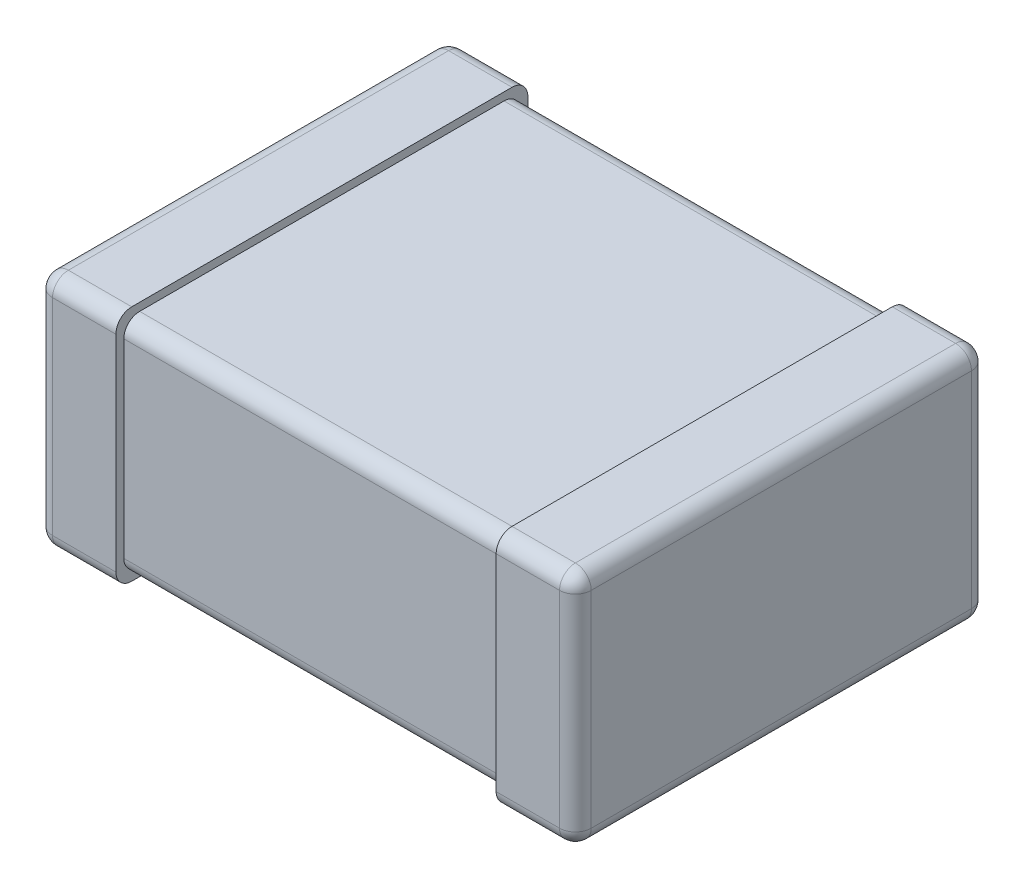
ISO-10303-21;
HEADER;
FILE_DESCRIPTION(('STEP AP214'),'2;1');
FILE_NAME('part.step','',(''),(''),'','','');
FILE_SCHEMA(('AUTOMOTIVE_DESIGN { 1 0 10303 214 1 1 1 1 }'));
ENDSEC;
DATA;
#1=APPLICATION_CONTEXT('core data for automotive mechanical design processes');
#2=APPLICATION_PROTOCOL_DEFINITION('international standard','automotive_design',2000,#1);
#3=PRODUCT_CONTEXT('',#1,'mechanical');
#4=PRODUCT('Part','Part','',(#3));
#5=PRODUCT_RELATED_PRODUCT_CATEGORY('part','',(#4));
#6=PRODUCT_DEFINITION_FORMATION('','',#4);
#7=PRODUCT_DEFINITION_CONTEXT('part definition',#1,'design');
#8=PRODUCT_DEFINITION('design','',#6,#7);
#9=PRODUCT_DEFINITION_SHAPE('','',#8);
#10=(LENGTH_UNIT() NAMED_UNIT(*) SI_UNIT(.MILLI.,.METRE.));
#11=(NAMED_UNIT(*) PLANE_ANGLE_UNIT() SI_UNIT($,.RADIAN.));
#12=(NAMED_UNIT(*) SI_UNIT($,.STERADIAN.) SOLID_ANGLE_UNIT());
#13=UNCERTAINTY_MEASURE_WITH_UNIT(LENGTH_MEASURE(1.E-05),#10,'distance_accuracy_value','');
#14=(GEOMETRIC_REPRESENTATION_CONTEXT(3) GLOBAL_UNCERTAINTY_ASSIGNED_CONTEXT((#13)) GLOBAL_UNIT_ASSIGNED_CONTEXT((#10,
#11,#12)) REPRESENTATION_CONTEXT('',''));
#15=CARTESIAN_POINT('',(0.,0.,0.));
#16=DIRECTION('',(0.,0.,1.));
#17=DIRECTION('',(1.,0.,0.));
#18=AXIS2_PLACEMENT_3D('',#15,#16,#17);
#19=CARTESIAN_POINT('',(0.5,1.5,-1.3));
#20=DIRECTION('',(0.,0.,1.));
#21=DIRECTION('',(1.,0.,0.));
#22=AXIS2_PLACEMENT_3D('',#19,#20,#21);
#23=PLANE('',#22);
#24=DIRECTION('',(0.,-1.,0.));
#25=VECTOR('',#24,1.);
#26=CARTESIAN_POINT('',(0.0999999999999995,1.5,-1.3));
#27=LINE('',#26,#25);
#28=CARTESIAN_POINT('',(0.0999999999999995,0.1,-1.3));
#29=VERTEX_POINT('',#28);
#30=CARTESIAN_POINT('',(0.0999999999999995,1.4,-1.3));
#31=VERTEX_POINT('',#30);
#32=EDGE_CURVE('E320',#29,#31,#27,.F.);
#33=ORIENTED_EDGE('',*,*,#32,.T.);
#34=DIRECTION('',(-1.,0.,0.));
#35=VECTOR('',#34,1.);
#36=CARTESIAN_POINT('',(0.5,1.4,-1.3));
#37=LINE('',#36,#35);
#38=CARTESIAN_POINT('',(0.5,1.4,-1.3));
#39=VERTEX_POINT('',#38);
#40=EDGE_CURVE('E324',#31,#39,#37,.F.);
#41=ORIENTED_EDGE('',*,*,#40,.T.);
#42=DIRECTION('',(0.,-1.,0.));
#43=VECTOR('',#42,1.);
#44=CARTESIAN_POINT('',(0.5,1.5,-1.3));
#45=LINE('',#44,#43);
#46=CARTESIAN_POINT('',(0.5,0.1,-1.3));
#47=VERTEX_POINT('',#46);
#48=EDGE_CURVE('E254',#39,#47,#45,.T.);
#49=ORIENTED_EDGE('',*,*,#48,.T.);
#50=DIRECTION('',(-1.,0.,0.));
#51=VECTOR('',#50,1.);
#52=CARTESIAN_POINT('',(0.5,0.1,-1.3));
#53=LINE('',#52,#51);
#54=EDGE_CURVE('E322',#47,#29,#53,.T.);
#55=ORIENTED_EDGE('',*,*,#54,.T.);
#56=EDGE_LOOP('',(#33,#41,#49,#55));
#57=FACE_BOUND('',#56,.T.);
#58=ADVANCED_FACE('F36',(#57),#23,.F.);
#59=CARTESIAN_POINT('',(0.,1.5,-1.3));
#60=DIRECTION('',(1.,0.,0.));
#61=DIRECTION('',(0.,0.,-1.));
#62=AXIS2_PLACEMENT_3D('',#59,#60,#61);
#63=PLANE('',#62);
#64=DIRECTION('',(0.,0.,1.));
#65=VECTOR('',#64,1.);
#66=CARTESIAN_POINT('',(0.,1.4,-1.3));
#67=LINE('',#66,#65);
#68=CARTESIAN_POINT('',(0.,1.4,1.2));
#69=VERTEX_POINT('',#68);
#70=CARTESIAN_POINT('',(0.,1.4,-1.2));
#71=VERTEX_POINT('',#70);
#72=EDGE_CURVE('E340',#69,#71,#67,.F.);
#73=ORIENTED_EDGE('',*,*,#72,.T.);
#74=DIRECTION('',(0.,-1.,0.));
#75=VECTOR('',#74,1.);
#76=CARTESIAN_POINT('',(0.,1.5,-1.2));
#77=LINE('',#76,#75);
#78=CARTESIAN_POINT('',(0.,0.1,-1.2));
#79=VERTEX_POINT('',#78);
#80=EDGE_CURVE('E346',#71,#79,#77,.T.);
#81=ORIENTED_EDGE('',*,*,#80,.T.);
#82=DIRECTION('',(0.,0.,1.));
#83=VECTOR('',#82,1.);
#84=CARTESIAN_POINT('',(0.,0.1,-1.3));
#85=LINE('',#84,#83);
#86=CARTESIAN_POINT('',(0.,0.1,1.2));
#87=VERTEX_POINT('',#86);
#88=EDGE_CURVE('E344',#79,#87,#85,.T.);
#89=ORIENTED_EDGE('',*,*,#88,.T.);
#90=DIRECTION('',(0.,-1.,0.));
#91=VECTOR('',#90,1.);
#92=CARTESIAN_POINT('',(0.,1.5,1.2));
#93=LINE('',#92,#91);
#94=EDGE_CURVE('E342',#87,#69,#93,.F.);
#95=ORIENTED_EDGE('',*,*,#94,.T.);
#96=EDGE_LOOP('',(#73,#81,#89,#95));
#97=FACE_BOUND('',#96,.T.);
#98=ADVANCED_FACE('F457',(#97),#63,.F.);
#99=CARTESIAN_POINT('',(0.,1.5,1.3));
#100=DIRECTION('',(0.,0.,-1.));
#101=DIRECTION('',(-1.,0.,0.));
#102=AXIS2_PLACEMENT_3D('',#99,#100,#101);
#103=PLANE('',#102);
#104=DIRECTION('',(0.,-1.,0.));
#105=VECTOR('',#104,1.);
#106=CARTESIAN_POINT('',(0.1,1.5,1.3));
#107=LINE('',#106,#105);
#108=CARTESIAN_POINT('',(0.1,1.4,1.3));
#109=VERTEX_POINT('',#108);
#110=CARTESIAN_POINT('',(0.1,0.1,1.3));
#111=VERTEX_POINT('',#110);
#112=EDGE_CURVE('E53',#109,#111,#107,.T.);
#113=ORIENTED_EDGE('',*,*,#112,.T.);
#114=DIRECTION('',(1.,0.,0.));
#115=VECTOR('',#114,1.);
#116=CARTESIAN_POINT('',(0.,0.1,1.3));
#117=LINE('',#116,#115);
#118=CARTESIAN_POINT('',(0.5,0.1,1.3));
#119=VERTEX_POINT('',#118);
#120=EDGE_CURVE('E351',#111,#119,#117,.T.);
#121=ORIENTED_EDGE('',*,*,#120,.T.);
#122=DIRECTION('',(0.,-1.,0.));
#123=VECTOR('',#122,1.);
#124=CARTESIAN_POINT('',(0.5,1.5,1.3));
#125=LINE('',#124,#123);
#126=CARTESIAN_POINT('',(0.5,1.4,1.3));
#127=VERTEX_POINT('',#126);
#128=EDGE_CURVE('E249',#127,#119,#125,.T.);
#129=ORIENTED_EDGE('',*,*,#128,.F.);
#130=DIRECTION('',(1.,0.,0.));
#131=VECTOR('',#130,1.);
#132=CARTESIAN_POINT('',(0.,1.4,1.3));
#133=LINE('',#132,#131);
#134=EDGE_CURVE('E58',#127,#109,#133,.F.);
#135=ORIENTED_EDGE('',*,*,#134,.T.);
#136=EDGE_LOOP('',(#113,#121,#129,#135));
#137=FACE_BOUND('',#136,.T.);
#138=ADVANCED_FACE('F438',(#137),#103,.F.);
#139=CARTESIAN_POINT('',(0.5,1.5,1.3));
#140=DIRECTION('',(-1.,0.,0.));
#141=DIRECTION('',(0.,0.,1.));
#142=AXIS2_PLACEMENT_3D('',#139,#140,#141);
#143=PLANE('',#142);
#144=DIRECTION('',(0.,-1.,0.));
#145=VECTOR('',#144,1.);
#146=CARTESIAN_POINT('',(0.5,1.45,1.25));
#147=LINE('',#146,#145);
#148=CARTESIAN_POINT('',(0.5,1.35,1.25));
#149=VERTEX_POINT('',#148);
#150=CARTESIAN_POINT('',(0.5,0.15,1.25));
#151=VERTEX_POINT('',#150);
#152=EDGE_CURVE('E245',#149,#151,#147,.T.);
#153=ORIENTED_EDGE('',*,*,#152,.F.);
#154=CARTESIAN_POINT('',(0.5,1.35,1.15));
#155=DIRECTION('',(-1.,0.,0.));
#156=DIRECTION('',(0.,0.,1.));
#157=AXIS2_PLACEMENT_3D('',#154,#155,#156);
#158=CIRCLE('',#157,0.1);
#159=CARTESIAN_POINT('',(0.5,1.45,1.15));
#160=VERTEX_POINT('',#159);
#161=EDGE_CURVE('E12',#149,#160,#158,.T.);
#162=ORIENTED_EDGE('',*,*,#161,.T.);
#163=DIRECTION('',(0.,0.,1.));
#164=VECTOR('',#163,1.);
#165=CARTESIAN_POINT('',(0.5,1.45,-1.25));
#166=LINE('',#165,#164);
#167=CARTESIAN_POINT('',(0.5,1.45,-1.15));
#168=VERTEX_POINT('',#167);
#169=EDGE_CURVE('E228',#168,#160,#166,.T.);
#170=ORIENTED_EDGE('',*,*,#169,.F.);
#171=CARTESIAN_POINT('',(0.5,1.35,-1.15));
#172=DIRECTION('',(-1.,0.,0.));
#173=DIRECTION('',(0.,0.,1.));
#174=AXIS2_PLACEMENT_3D('',#171,#172,#173);
#175=CIRCLE('',#174,0.1);
#176=CARTESIAN_POINT('',(0.5,1.35,-1.25));
#177=VERTEX_POINT('',#176);
#178=EDGE_CURVE('E221',#168,#177,#175,.T.);
#179=ORIENTED_EDGE('',*,*,#178,.T.);
#180=DIRECTION('',(0.,-1.,0.));
#181=VECTOR('',#180,1.);
#182=CARTESIAN_POINT('',(0.5,1.45,-1.25));
#183=LINE('',#182,#181);
#184=CARTESIAN_POINT('',(0.5,0.15,-1.25));
#185=VERTEX_POINT('',#184);
#186=EDGE_CURVE('E226',#177,#185,#183,.T.);
#187=ORIENTED_EDGE('',*,*,#186,.T.);
#188=CARTESIAN_POINT('',(0.5,0.15,-1.15));
#189=DIRECTION('',(-1.,0.,0.));
#190=DIRECTION('',(0.,0.,1.));
#191=AXIS2_PLACEMENT_3D('',#188,#189,#190);
#192=CIRCLE('',#191,0.1);
#193=CARTESIAN_POINT('',(0.5,0.05,-1.15));
#194=VERTEX_POINT('',#193);
#195=EDGE_CURVE('E353',#185,#194,#192,.T.);
#196=ORIENTED_EDGE('',*,*,#195,.T.);
#197=DIRECTION('',(0.,0.,1.));
#198=VECTOR('',#197,1.);
#199=CARTESIAN_POINT('',(0.5,0.05,-1.25));
#200=LINE('',#199,#198);
#201=CARTESIAN_POINT('',(0.5,0.05,1.15));
#202=VERTEX_POINT('',#201);
#203=EDGE_CURVE('E490',#194,#202,#200,.T.);
#204=ORIENTED_EDGE('',*,*,#203,.T.);
#205=CARTESIAN_POINT('',(0.5,0.15,1.15));
#206=DIRECTION('',(-1.,0.,0.));
#207=DIRECTION('',(0.,0.,1.));
#208=AXIS2_PLACEMENT_3D('',#205,#206,#207);
#209=CIRCLE('',#208,0.1);
#210=EDGE_CURVE('E359',#202,#151,#209,.T.);
#211=ORIENTED_EDGE('',*,*,#210,.T.);
#212=EDGE_LOOP('',(#153,#162,#170,#179,#187,#196,#204,#211));
#213=FACE_BOUND('',#212,.T.);
#214=ORIENTED_EDGE('',*,*,#48,.F.);
#215=CARTESIAN_POINT('',(0.5,1.4,-1.2));
#216=DIRECTION('',(-1.,0.,0.));
#217=DIRECTION('',(0.,0.,1.));
#218=AXIS2_PLACEMENT_3D('',#215,#216,#217);
#219=CIRCLE('',#218,0.1);
#220=CARTESIAN_POINT('',(0.5,1.5,-1.2));
#221=VERTEX_POINT('',#220);
#222=EDGE_CURVE('E332',#39,#221,#219,.F.);
#223=ORIENTED_EDGE('',*,*,#222,.T.);
#224=DIRECTION('',(0.,0.,-1.));
#225=VECTOR('',#224,1.);
#226=CARTESIAN_POINT('',(0.5,1.5,1.3));
#227=LINE('',#226,#225);
#228=CARTESIAN_POINT('',(0.5,1.5,1.2));
#229=VERTEX_POINT('',#228);
#230=EDGE_CURVE('E445',#229,#221,#227,.T.);
#231=ORIENTED_EDGE('',*,*,#230,.F.);
#232=CARTESIAN_POINT('',(0.5,1.4,1.2));
#233=DIRECTION('',(-1.,0.,0.));
#234=DIRECTION('',(0.,0.,1.));
#235=AXIS2_PLACEMENT_3D('',#232,#233,#234);
#236=CIRCLE('',#235,0.1);
#237=EDGE_CURVE('E326',#229,#127,#236,.F.);
#238=ORIENTED_EDGE('',*,*,#237,.T.);
#239=ORIENTED_EDGE('',*,*,#128,.T.);
#240=CARTESIAN_POINT('',(0.5,0.1,1.2));
#241=DIRECTION('',(-1.,0.,0.));
#242=DIRECTION('',(0.,0.,1.));
#243=AXIS2_PLACEMENT_3D('',#240,#241,#242);
#244=CIRCLE('',#243,0.1);
#245=CARTESIAN_POINT('',(0.5,0.,1.2));
#246=VERTEX_POINT('',#245);
#247=EDGE_CURVE('E328',#119,#246,#244,.F.);
#248=ORIENTED_EDGE('',*,*,#247,.T.);
#249=DIRECTION('',(0.,0.,-1.));
#250=VECTOR('',#249,1.);
#251=CARTESIAN_POINT('',(0.5,0.,1.3));
#252=LINE('',#251,#250);
#253=CARTESIAN_POINT('',(0.5,0.,-1.2));
#254=VERTEX_POINT('',#253);
#255=EDGE_CURVE('E244',#246,#254,#252,.T.);
#256=ORIENTED_EDGE('',*,*,#255,.T.);
#257=CARTESIAN_POINT('',(0.5,0.1,-1.2));
#258=DIRECTION('',(-1.,0.,0.));
#259=DIRECTION('',(0.,0.,1.));
#260=AXIS2_PLACEMENT_3D('',#257,#258,#259);
#261=CIRCLE('',#260,0.1);
#262=EDGE_CURVE('E330',#254,#47,#261,.F.);
#263=ORIENTED_EDGE('',*,*,#262,.T.);
#264=EDGE_LOOP('',(#214,#223,#231,#238,#239,#248,#256,#263));
#265=FACE_BOUND('',#264,.T.);
#266=ADVANCED_FACE('F224',(#213,#265),#143,.F.);
#267=CARTESIAN_POINT('',(0.,1.5,-1.3));
#268=DIRECTION('',(0.,1.,0.));
#269=DIRECTION('',(0.,0.,1.));
#270=AXIS2_PLACEMENT_3D('',#267,#268,#269);
#271=PLANE('',#270);
#272=ORIENTED_EDGE('',*,*,#230,.T.);
#273=DIRECTION('',(-1.,0.,0.));
#274=VECTOR('',#273,1.);
#275=CARTESIAN_POINT('',(0.,1.5,-1.2));
#276=LINE('',#275,#274);
#277=CARTESIAN_POINT('',(0.0999999999999996,1.5,-1.2));
#278=VERTEX_POINT('',#277);
#279=EDGE_CURVE('E317',#221,#278,#276,.T.);
#280=ORIENTED_EDGE('',*,*,#279,.T.);
#281=DIRECTION('',(0.,0.,1.));
#282=VECTOR('',#281,1.);
#283=CARTESIAN_POINT('',(0.1,1.5,1.3));
#284=LINE('',#283,#282);
#285=CARTESIAN_POINT('',(0.1,1.5,1.2));
#286=VERTEX_POINT('',#285);
#287=EDGE_CURVE('E313',#278,#286,#284,.T.);
#288=ORIENTED_EDGE('',*,*,#287,.T.);
#289=DIRECTION('',(1.,0.,0.));
#290=VECTOR('',#289,1.);
#291=CARTESIAN_POINT('',(0.5,1.5,1.2));
#292=LINE('',#291,#290);
#293=EDGE_CURVE('E315',#286,#229,#292,.T.);
#294=ORIENTED_EDGE('',*,*,#293,.T.);
#295=EDGE_LOOP('',(#272,#280,#288,#294));
#296=FACE_BOUND('',#295,.T.);
#297=ADVANCED_FACE('F899',(#296),#271,.T.);
#298=CARTESIAN_POINT('',(0.,0.,-1.3));
#299=DIRECTION('',(0.,1.,0.));
#300=DIRECTION('',(0.,0.,1.));
#301=AXIS2_PLACEMENT_3D('',#298,#299,#300);
#302=PLANE('',#301);
#303=DIRECTION('',(0.,0.,1.));
#304=VECTOR('',#303,1.);
#305=CARTESIAN_POINT('',(0.0999999999999995,0.,-1.3));
#306=LINE('',#305,#304);
#307=CARTESIAN_POINT('',(0.1,0.,1.2));
#308=VERTEX_POINT('',#307);
#309=CARTESIAN_POINT('',(0.0999999999999995,0.,-1.2));
#310=VERTEX_POINT('',#309);
#311=EDGE_CURVE('E336',#308,#310,#306,.F.);
#312=ORIENTED_EDGE('',*,*,#311,.T.);
#313=DIRECTION('',(-1.,0.,0.));
#314=VECTOR('',#313,1.);
#315=CARTESIAN_POINT('',(0.,0.,-1.2));
#316=LINE('',#315,#314);
#317=EDGE_CURVE('E338',#310,#254,#316,.F.);
#318=ORIENTED_EDGE('',*,*,#317,.T.);
#319=ORIENTED_EDGE('',*,*,#255,.F.);
#320=DIRECTION('',(1.,0.,0.));
#321=VECTOR('',#320,1.);
#322=CARTESIAN_POINT('',(0.,0.,1.2));
#323=LINE('',#322,#321);
#324=EDGE_CURVE('E334',#246,#308,#323,.F.);
#325=ORIENTED_EDGE('',*,*,#324,.T.);
#326=EDGE_LOOP('',(#312,#318,#319,#325));
#327=FACE_BOUND('',#326,.T.);
#328=ADVANCED_FACE('F465',(#327),#302,.F.);
#329=CARTESIAN_POINT('',(2.9,1.45,-1.25));
#330=DIRECTION('',(0.,0.,1.));
#331=DIRECTION('',(1.,0.,0.));
#332=AXIS2_PLACEMENT_3D('',#329,#330,#331);
#333=PLANE('',#332);
#334=DIRECTION('',(0.,-1.,0.));
#335=VECTOR('',#334,1.);
#336=CARTESIAN_POINT('',(2.9,1.45,-1.25));
#337=LINE('',#336,#335);
#338=CARTESIAN_POINT('',(2.9,1.35,-1.25));
#339=VERTEX_POINT('',#338);
#340=CARTESIAN_POINT('',(2.9,0.15,-1.25));
#341=VERTEX_POINT('',#340);
#342=EDGE_CURVE('E484',#339,#341,#337,.T.);
#343=ORIENTED_EDGE('',*,*,#342,.T.);
#344=DIRECTION('',(-1.,0.,0.));
#345=VECTOR('',#344,1.);
#346=CARTESIAN_POINT('',(2.9,0.15,-1.25));
#347=LINE('',#346,#345);
#348=EDGE_CURVE('E243',#341,#185,#347,.T.);
#349=ORIENTED_EDGE('',*,*,#348,.T.);
#350=ORIENTED_EDGE('',*,*,#186,.F.);
#351=DIRECTION('',(-1.,0.,0.));
#352=VECTOR('',#351,1.);
#353=CARTESIAN_POINT('',(2.9,1.35,-1.25));
#354=LINE('',#353,#352);
#355=EDGE_CURVE('E240',#177,#339,#354,.F.);
#356=ORIENTED_EDGE('',*,*,#355,.T.);
#357=EDGE_LOOP('',(#343,#349,#350,#356));
#358=FACE_BOUND('',#357,.T.);
#359=ADVANCED_FACE('F239',(#358),#333,.F.);
#360=CARTESIAN_POINT('',(0.5,1.45,1.25));
#361=DIRECTION('',(0.,0.,-1.));
#362=DIRECTION('',(-1.,0.,0.));
#363=AXIS2_PLACEMENT_3D('',#360,#361,#362);
#364=PLANE('',#363);
#365=ORIENTED_EDGE('',*,*,#152,.T.);
#366=DIRECTION('',(1.,0.,0.));
#367=VECTOR('',#366,1.);
#368=CARTESIAN_POINT('',(0.5,0.15,1.25));
#369=LINE('',#368,#367);
#370=CARTESIAN_POINT('',(2.9,0.15,1.25));
#371=VERTEX_POINT('',#370);
#372=EDGE_CURVE('E268',#151,#371,#369,.T.);
#373=ORIENTED_EDGE('',*,*,#372,.T.);
#374=DIRECTION('',(0.,-1.,0.));
#375=VECTOR('',#374,1.);
#376=CARTESIAN_POINT('',(2.9,1.45,1.25));
#377=LINE('',#376,#375);
#378=CARTESIAN_POINT('',(2.9,1.35,1.25));
#379=VERTEX_POINT('',#378);
#380=EDGE_CURVE('E481',#379,#371,#377,.T.);
#381=ORIENTED_EDGE('',*,*,#380,.F.);
#382=DIRECTION('',(1.,0.,0.));
#383=VECTOR('',#382,1.);
#384=CARTESIAN_POINT('',(0.5,1.35,1.25));
#385=LINE('',#384,#383);
#386=EDGE_CURVE('E266',#379,#149,#385,.F.);
#387=ORIENTED_EDGE('',*,*,#386,.T.);
#388=EDGE_LOOP('',(#365,#373,#381,#387));
#389=FACE_BOUND('',#388,.T.);
#390=ADVANCED_FACE('F834',(#389),#364,.F.);
#391=CARTESIAN_POINT('',(0.5,1.45,-1.25));
#392=DIRECTION('',(0.,1.,0.));
#393=DIRECTION('',(0.,0.,1.));
#394=AXIS2_PLACEMENT_3D('',#391,#392,#393);
#395=PLANE('',#394);
#396=DIRECTION('',(0.,0.,-1.));
#397=VECTOR('',#396,1.);
#398=CARTESIAN_POINT('',(2.9,1.45,1.25));
#399=LINE('',#398,#397);
#400=CARTESIAN_POINT('',(2.9,1.45,1.15));
#401=VERTEX_POINT('',#400);
#402=CARTESIAN_POINT('',(2.9,1.45,-1.15));
#403=VERTEX_POINT('',#402);
#404=EDGE_CURVE('E486',#401,#403,#399,.T.);
#405=ORIENTED_EDGE('',*,*,#404,.T.);
#406=DIRECTION('',(-1.,0.,0.));
#407=VECTOR('',#406,1.);
#408=CARTESIAN_POINT('',(0.5,1.45,-1.15));
#409=LINE('',#408,#407);
#410=EDGE_CURVE('E264',#403,#168,#409,.T.);
#411=ORIENTED_EDGE('',*,*,#410,.T.);
#412=ORIENTED_EDGE('',*,*,#169,.T.);
#413=DIRECTION('',(1.,0.,0.));
#414=VECTOR('',#413,1.);
#415=CARTESIAN_POINT('',(2.9,1.45,1.15));
#416=LINE('',#415,#414);
#417=EDGE_CURVE('E261',#160,#401,#416,.T.);
#418=ORIENTED_EDGE('',*,*,#417,.T.);
#419=EDGE_LOOP('',(#405,#411,#412,#418));
#420=FACE_BOUND('',#419,.T.);
#421=ADVANCED_FACE('F824',(#420),#395,.T.);
#422=CARTESIAN_POINT('',(0.5,0.05,-1.25));
#423=DIRECTION('',(0.,1.,0.));
#424=DIRECTION('',(0.,0.,1.));
#425=AXIS2_PLACEMENT_3D('',#422,#423,#424);
#426=PLANE('',#425);
#427=ORIENTED_EDGE('',*,*,#203,.F.);
#428=DIRECTION('',(-1.,0.,0.));
#429=VECTOR('',#428,1.);
#430=CARTESIAN_POINT('',(0.5,0.05,-1.15));
#431=LINE('',#430,#429);
#432=CARTESIAN_POINT('',(2.9,0.05,-1.15));
#433=VERTEX_POINT('',#432);
#434=EDGE_CURVE('E259',#194,#433,#431,.F.);
#435=ORIENTED_EDGE('',*,*,#434,.T.);
#436=DIRECTION('',(0.,0.,-1.));
#437=VECTOR('',#436,1.);
#438=CARTESIAN_POINT('',(2.9,0.05,1.25));
#439=LINE('',#438,#437);
#440=CARTESIAN_POINT('',(2.9,0.05,1.15));
#441=VERTEX_POINT('',#440);
#442=EDGE_CURVE('E487',#441,#433,#439,.T.);
#443=ORIENTED_EDGE('',*,*,#442,.F.);
#444=DIRECTION('',(1.,0.,0.));
#445=VECTOR('',#444,1.);
#446=CARTESIAN_POINT('',(0.499999999999999,0.05,1.15));
#447=LINE('',#446,#445);
#448=EDGE_CURVE('E251',#441,#202,#447,.F.);
#449=ORIENTED_EDGE('',*,*,#448,.T.);
#450=EDGE_LOOP('',(#427,#435,#443,#449));
#451=FACE_BOUND('',#450,.T.);
#452=ADVANCED_FACE('F818',(#451),#426,.F.);
#453=CARTESIAN_POINT('',(2.9,1.5,-1.3));
#454=DIRECTION('',(0.,0.,1.));
#455=DIRECTION('',(1.,0.,0.));
#456=AXIS2_PLACEMENT_3D('',#453,#454,#455);
#457=PLANE('',#456);
#458=DIRECTION('',(0.,-1.,0.));
#459=VECTOR('',#458,1.);
#460=CARTESIAN_POINT('',(2.9,1.5,-1.3));
#461=LINE('',#460,#459);
#462=CARTESIAN_POINT('',(2.9,1.4,-1.3));
#463=VERTEX_POINT('',#462);
#464=CARTESIAN_POINT('',(2.9,0.1,-1.3));
#465=VERTEX_POINT('',#464);
#466=EDGE_CURVE('E493',#463,#465,#461,.T.);
#467=ORIENTED_EDGE('',*,*,#466,.F.);
#468=DIRECTION('',(-1.,0.,0.));
#469=VECTOR('',#468,1.);
#470=CARTESIAN_POINT('',(2.9,1.4,-1.3));
#471=LINE('',#470,#469);
#472=CARTESIAN_POINT('',(3.3,1.4,-1.3));
#473=VERTEX_POINT('',#472);
#474=EDGE_CURVE('E296',#463,#473,#471,.F.);
#475=ORIENTED_EDGE('',*,*,#474,.T.);
#476=DIRECTION('',(0.,-1.,0.));
#477=VECTOR('',#476,1.);
#478=CARTESIAN_POINT('',(3.3,1.5,-1.3));
#479=LINE('',#478,#477);
#480=CARTESIAN_POINT('',(3.3,0.1,-1.3));
#481=VERTEX_POINT('',#480);
#482=EDGE_CURVE('E292',#473,#481,#479,.T.);
#483=ORIENTED_EDGE('',*,*,#482,.T.);
#484=DIRECTION('',(-1.,0.,0.));
#485=VECTOR('',#484,1.);
#486=CARTESIAN_POINT('',(2.9,0.1,-1.3));
#487=LINE('',#486,#485);
#488=EDGE_CURVE('E294',#481,#465,#487,.T.);
#489=ORIENTED_EDGE('',*,*,#488,.T.);
#490=EDGE_LOOP('',(#467,#475,#483,#489));
#491=FACE_BOUND('',#490,.T.);
#492=ADVANCED_FACE('F543',(#491),#457,.F.);
#493=CARTESIAN_POINT('',(2.9,1.5,-1.3));
#494=DIRECTION('',(1.,0.,0.));
#495=DIRECTION('',(0.,0.,-1.));
#496=AXIS2_PLACEMENT_3D('',#493,#494,#495);
#497=PLANE('',#496);
#498=ORIENTED_EDGE('',*,*,#404,.F.);
#499=CARTESIAN_POINT('',(2.9,1.35,1.15));
#500=DIRECTION('',(1.,0.,0.));
#501=DIRECTION('',(0.,0.,-1.));
#502=AXIS2_PLACEMENT_3D('',#499,#500,#501);
#503=CIRCLE('',#502,0.1);
#504=EDGE_CURVE('E45',#401,#379,#503,.T.);
#505=ORIENTED_EDGE('',*,*,#504,.T.);
#506=ORIENTED_EDGE('',*,*,#380,.T.);
#507=CARTESIAN_POINT('',(2.9,0.15,1.15));
#508=DIRECTION('',(1.,0.,0.));
#509=DIRECTION('',(0.,0.,-1.));
#510=AXIS2_PLACEMENT_3D('',#507,#508,#509);
#511=CIRCLE('',#510,0.1);
#512=EDGE_CURVE('E357',#371,#441,#511,.T.);
#513=ORIENTED_EDGE('',*,*,#512,.T.);
#514=ORIENTED_EDGE('',*,*,#442,.T.);
#515=CARTESIAN_POINT('',(2.9,0.15,-1.15));
#516=DIRECTION('',(1.,0.,0.));
#517=DIRECTION('',(0.,0.,-1.));
#518=AXIS2_PLACEMENT_3D('',#515,#516,#517);
#519=CIRCLE('',#518,0.1);
#520=EDGE_CURVE('E234',#433,#341,#519,.T.);
#521=ORIENTED_EDGE('',*,*,#520,.T.);
#522=ORIENTED_EDGE('',*,*,#342,.F.);
#523=CARTESIAN_POINT('',(2.9,1.35,-1.15));
#524=DIRECTION('',(1.,0.,0.));
#525=DIRECTION('',(0.,0.,-1.));
#526=AXIS2_PLACEMENT_3D('',#523,#524,#525);
#527=CIRCLE('',#526,0.1);
#528=EDGE_CURVE('E233',#339,#403,#527,.T.);
#529=ORIENTED_EDGE('',*,*,#528,.T.);
#530=EDGE_LOOP('',(#498,#505,#506,#513,#514,#521,#522,#529));
#531=FACE_BOUND('',#530,.T.);
#532=DIRECTION('',(0.,-1.,0.));
#533=VECTOR('',#532,1.);
#534=CARTESIAN_POINT('',(2.9,1.5,1.3));
#535=LINE('',#534,#533);
#536=CARTESIAN_POINT('',(2.9,1.4,1.3));
#537=VERTEX_POINT('',#536);
#538=CARTESIAN_POINT('',(2.9,0.1,1.3));
#539=VERTEX_POINT('',#538);
#540=EDGE_CURVE('E499',#537,#539,#535,.T.);
#541=ORIENTED_EDGE('',*,*,#540,.F.);
#542=CARTESIAN_POINT('',(2.9,1.4,1.2));
#543=DIRECTION('',(1.,0.,0.));
#544=DIRECTION('',(0.,0.,-1.));
#545=AXIS2_PLACEMENT_3D('',#542,#543,#544);
#546=CIRCLE('',#545,0.1);
#547=CARTESIAN_POINT('',(2.9,1.5,1.2));
#548=VERTEX_POINT('',#547);
#549=EDGE_CURVE('E290',#537,#548,#546,.F.);
#550=ORIENTED_EDGE('',*,*,#549,.T.);
#551=DIRECTION('',(0.,0.,1.));
#552=VECTOR('',#551,1.);
#553=CARTESIAN_POINT('',(2.9,1.5,-1.3));
#554=LINE('',#553,#552);
#555=CARTESIAN_POINT('',(2.9,1.5,-1.2));
#556=VERTEX_POINT('',#555);
#557=EDGE_CURVE('E502',#556,#548,#554,.T.);
#558=ORIENTED_EDGE('',*,*,#557,.F.);
#559=CARTESIAN_POINT('',(2.9,1.4,-1.2));
#560=DIRECTION('',(1.,0.,0.));
#561=DIRECTION('',(0.,0.,-1.));
#562=AXIS2_PLACEMENT_3D('',#559,#560,#561);
#563=CIRCLE('',#562,0.1);
#564=EDGE_CURVE('E288',#556,#463,#563,.F.);
#565=ORIENTED_EDGE('',*,*,#564,.T.);
#566=ORIENTED_EDGE('',*,*,#466,.T.);
#567=CARTESIAN_POINT('',(2.9,0.1,-1.2));
#568=DIRECTION('',(1.,0.,0.));
#569=DIRECTION('',(0.,0.,-1.));
#570=AXIS2_PLACEMENT_3D('',#567,#568,#569);
#571=CIRCLE('',#570,0.1);
#572=CARTESIAN_POINT('',(2.9,0.,-1.2));
#573=VERTEX_POINT('',#572);
#574=EDGE_CURVE('E284',#465,#573,#571,.F.);
#575=ORIENTED_EDGE('',*,*,#574,.T.);
#576=DIRECTION('',(0.,0.,1.));
#577=VECTOR('',#576,1.);
#578=CARTESIAN_POINT('',(2.9,0.,-1.3));
#579=LINE('',#578,#577);
#580=CARTESIAN_POINT('',(2.9,0.,1.2));
#581=VERTEX_POINT('',#580);
#582=EDGE_CURVE('E396',#573,#581,#579,.T.);
#583=ORIENTED_EDGE('',*,*,#582,.T.);
#584=CARTESIAN_POINT('',(2.9,0.1,1.2));
#585=DIRECTION('',(1.,0.,0.));
#586=DIRECTION('',(0.,0.,-1.));
#587=AXIS2_PLACEMENT_3D('',#584,#585,#586);
#588=CIRCLE('',#587,0.1);
#589=EDGE_CURVE('E286',#581,#539,#588,.F.);
#590=ORIENTED_EDGE('',*,*,#589,.T.);
#591=EDGE_LOOP('',(#541,#550,#558,#565,#566,#575,#583,#590));
#592=FACE_BOUND('',#591,.T.);
#593=ADVANCED_FACE('F568',(#531,#592),#497,.F.);
#594=CARTESIAN_POINT('',(3.4,1.5,1.3));
#595=DIRECTION('',(0.,0.,-1.));
#596=DIRECTION('',(-1.,0.,0.));
#597=AXIS2_PLACEMENT_3D('',#594,#595,#596);
#598=PLANE('',#597);
#599=DIRECTION('',(0.,-1.,0.));
#600=VECTOR('',#599,1.);
#601=CARTESIAN_POINT('',(3.3,1.5,1.3));
#602=LINE('',#601,#600);
#603=CARTESIAN_POINT('',(3.3,0.1,1.3));
#604=VERTEX_POINT('',#603);
#605=CARTESIAN_POINT('',(3.3,1.4,1.3));
#606=VERTEX_POINT('',#605);
#607=EDGE_CURVE('E280',#604,#606,#602,.F.);
#608=ORIENTED_EDGE('',*,*,#607,.T.);
#609=DIRECTION('',(1.,0.,0.));
#610=VECTOR('',#609,1.);
#611=CARTESIAN_POINT('',(3.4,1.4,1.3));
#612=LINE('',#611,#610);
#613=EDGE_CURVE('E282',#606,#537,#612,.F.);
#614=ORIENTED_EDGE('',*,*,#613,.T.);
#615=ORIENTED_EDGE('',*,*,#540,.T.);
#616=DIRECTION('',(1.,0.,0.));
#617=VECTOR('',#616,1.);
#618=CARTESIAN_POINT('',(3.4,0.1,1.3));
#619=LINE('',#618,#617);
#620=EDGE_CURVE('E278',#539,#604,#619,.T.);
#621=ORIENTED_EDGE('',*,*,#620,.T.);
#622=EDGE_LOOP('',(#608,#614,#615,#621));
#623=FACE_BOUND('',#622,.T.);
#624=ADVANCED_FACE('F570',(#623),#598,.F.);
#625=CARTESIAN_POINT('',(3.4,1.5,-1.3));
#626=DIRECTION('',(-1.,0.,0.));
#627=DIRECTION('',(0.,0.,1.));
#628=AXIS2_PLACEMENT_3D('',#625,#626,#627);
#629=PLANE('',#628);
#630=DIRECTION('',(0.,-1.,0.));
#631=VECTOR('',#630,1.);
#632=CARTESIAN_POINT('',(3.4,1.5,-1.2));
#633=LINE('',#632,#631);
#634=CARTESIAN_POINT('',(3.4,0.1,-1.2));
#635=VERTEX_POINT('',#634);
#636=CARTESIAN_POINT('',(3.4,1.4,-1.2));
#637=VERTEX_POINT('',#636);
#638=EDGE_CURVE('E300',#635,#637,#633,.F.);
#639=ORIENTED_EDGE('',*,*,#638,.T.);
#640=DIRECTION('',(0.,0.,-1.));
#641=VECTOR('',#640,1.);
#642=CARTESIAN_POINT('',(3.4,1.4,-1.3));
#643=LINE('',#642,#641);
#644=CARTESIAN_POINT('',(3.4,1.4,1.2));
#645=VERTEX_POINT('',#644);
#646=EDGE_CURVE('E304',#637,#645,#643,.F.);
#647=ORIENTED_EDGE('',*,*,#646,.T.);
#648=DIRECTION('',(0.,-1.,0.));
#649=VECTOR('',#648,1.);
#650=CARTESIAN_POINT('',(3.4,1.5,1.2));
#651=LINE('',#650,#649);
#652=CARTESIAN_POINT('',(3.4,0.1,1.2));
#653=VERTEX_POINT('',#652);
#654=EDGE_CURVE('E302',#645,#653,#651,.T.);
#655=ORIENTED_EDGE('',*,*,#654,.T.);
#656=DIRECTION('',(0.,0.,-1.));
#657=VECTOR('',#656,1.);
#658=CARTESIAN_POINT('',(3.4,0.1,-1.3));
#659=LINE('',#658,#657);
#660=EDGE_CURVE('E298',#653,#635,#659,.T.);
#661=ORIENTED_EDGE('',*,*,#660,.T.);
#662=EDGE_LOOP('',(#639,#647,#655,#661));
#663=FACE_BOUND('',#662,.T.);
#664=ADVANCED_FACE('F575',(#663),#629,.F.);
#665=CARTESIAN_POINT('',(3.4,1.5,-1.3));
#666=DIRECTION('',(0.,-1.,0.));
#667=DIRECTION('',(0.,0.,-1.));
#668=AXIS2_PLACEMENT_3D('',#665,#666,#667);
#669=PLANE('',#668);
#670=ORIENTED_EDGE('',*,*,#557,.T.);
#671=DIRECTION('',(1.,0.,0.));
#672=VECTOR('',#671,1.);
#673=CARTESIAN_POINT('',(3.4,1.5,1.2));
#674=LINE('',#673,#672);
#675=CARTESIAN_POINT('',(3.3,1.5,1.2));
#676=VERTEX_POINT('',#675);
#677=EDGE_CURVE('E275',#548,#676,#674,.T.);
#678=ORIENTED_EDGE('',*,*,#677,.T.);
#679=DIRECTION('',(0.,0.,-1.));
#680=VECTOR('',#679,1.);
#681=CARTESIAN_POINT('',(3.3,1.5,-1.3));
#682=LINE('',#681,#680);
#683=CARTESIAN_POINT('',(3.3,1.5,-1.2));
#684=VERTEX_POINT('',#683);
#685=EDGE_CURVE('E271',#676,#684,#682,.T.);
#686=ORIENTED_EDGE('',*,*,#685,.T.);
#687=DIRECTION('',(-1.,0.,0.));
#688=VECTOR('',#687,1.);
#689=CARTESIAN_POINT('',(3.4,1.5,-1.2));
#690=LINE('',#689,#688);
#691=EDGE_CURVE('E273',#684,#556,#690,.T.);
#692=ORIENTED_EDGE('',*,*,#691,.T.);
#693=EDGE_LOOP('',(#670,#678,#686,#692));
#694=FACE_BOUND('',#693,.T.);
#695=ADVANCED_FACE('F509',(#694),#669,.F.);
#696=CARTESIAN_POINT('',(3.4,0.,-1.3));
#697=DIRECTION('',(0.,-1.,0.));
#698=DIRECTION('',(0.,0.,-1.));
#699=AXIS2_PLACEMENT_3D('',#696,#697,#698);
#700=PLANE('',#699);
#701=DIRECTION('',(0.,0.,-1.));
#702=VECTOR('',#701,1.);
#703=CARTESIAN_POINT('',(3.3,0.,1.3));
#704=LINE('',#703,#702);
#705=CARTESIAN_POINT('',(3.3,0.,-1.2));
#706=VERTEX_POINT('',#705);
#707=CARTESIAN_POINT('',(3.3,0.,1.2));
#708=VERTEX_POINT('',#707);
#709=EDGE_CURVE('E307',#706,#708,#704,.F.);
#710=ORIENTED_EDGE('',*,*,#709,.T.);
#711=DIRECTION('',(1.,0.,0.));
#712=VECTOR('',#711,1.);
#713=CARTESIAN_POINT('',(2.9,0.,1.2));
#714=LINE('',#713,#712);
#715=EDGE_CURVE('E311',#708,#581,#714,.F.);
#716=ORIENTED_EDGE('',*,*,#715,.T.);
#717=ORIENTED_EDGE('',*,*,#582,.F.);
#718=DIRECTION('',(-1.,0.,0.));
#719=VECTOR('',#718,1.);
#720=CARTESIAN_POINT('',(3.4,0.,-1.2));
#721=LINE('',#720,#719);
#722=EDGE_CURVE('E309',#573,#706,#721,.F.);
#723=ORIENTED_EDGE('',*,*,#722,.T.);
#724=EDGE_LOOP('',(#710,#716,#717,#723));
#725=FACE_BOUND('',#724,.T.);
#726=ADVANCED_FACE('F559',(#725),#700,.T.);
#727=CARTESIAN_POINT('',(2.9,0.15,-1.15));
#728=DIRECTION('',(-1.,0.,0.));
#729=DIRECTION('',(0.,0.,1.));
#730=AXIS2_PLACEMENT_3D('',#727,#728,#729);
#731=CYLINDRICAL_SURFACE('',#730,0.1);
#732=ORIENTED_EDGE('',*,*,#520,.F.);
#733=ORIENTED_EDGE('',*,*,#434,.F.);
#734=ORIENTED_EDGE('',*,*,#195,.F.);
#735=ORIENTED_EDGE('',*,*,#348,.F.);
#736=EDGE_LOOP('',(#732,#733,#734,#735));
#737=FACE_BOUND('',#736,.T.);
#738=ADVANCED_FACE('F594',(#737),#731,.T.);
#739=CARTESIAN_POINT('',(0.5,1.35,-1.15));
#740=DIRECTION('',(1.,0.,0.));
#741=DIRECTION('',(0.,0.,-1.));
#742=AXIS2_PLACEMENT_3D('',#739,#740,#741);
#743=CYLINDRICAL_SURFACE('',#742,0.1);
#744=ORIENTED_EDGE('',*,*,#528,.F.);
#745=ORIENTED_EDGE('',*,*,#355,.F.);
#746=ORIENTED_EDGE('',*,*,#178,.F.);
#747=ORIENTED_EDGE('',*,*,#410,.F.);
#748=EDGE_LOOP('',(#744,#745,#746,#747));
#749=FACE_BOUND('',#748,.T.);
#750=ADVANCED_FACE('F248',(#749),#743,.T.);
#751=CARTESIAN_POINT('',(0.5,0.15,1.15));
#752=DIRECTION('',(1.,0.,0.));
#753=DIRECTION('',(0.,0.,-1.));
#754=AXIS2_PLACEMENT_3D('',#751,#752,#753);
#755=CYLINDRICAL_SURFACE('',#754,0.1);
#756=ORIENTED_EDGE('',*,*,#210,.F.);
#757=ORIENTED_EDGE('',*,*,#448,.F.);
#758=ORIENTED_EDGE('',*,*,#512,.F.);
#759=ORIENTED_EDGE('',*,*,#372,.F.);
#760=EDGE_LOOP('',(#756,#757,#758,#759));
#761=FACE_BOUND('',#760,.T.);
#762=ADVANCED_FACE('F600',(#761),#755,.T.);
#763=CARTESIAN_POINT('',(0.499999999999999,1.35,1.15));
#764=DIRECTION('',(-1.,0.,0.));
#765=DIRECTION('',(0.,0.,1.));
#766=AXIS2_PLACEMENT_3D('',#763,#764,#765);
#767=CYLINDRICAL_SURFACE('',#766,0.1);
#768=ORIENTED_EDGE('',*,*,#161,.F.);
#769=ORIENTED_EDGE('',*,*,#386,.F.);
#770=ORIENTED_EDGE('',*,*,#504,.F.);
#771=ORIENTED_EDGE('',*,*,#417,.F.);
#772=EDGE_LOOP('',(#768,#769,#770,#771));
#773=FACE_BOUND('',#772,.T.);
#774=ADVANCED_FACE('F603',(#773),#767,.T.);
#775=CARTESIAN_POINT('',(2.9,0.1,-1.2));
#776=DIRECTION('',(1.,0.,0.));
#777=DIRECTION('',(0.,0.,-1.));
#778=AXIS2_PLACEMENT_3D('',#775,#776,#777);
#779=CYLINDRICAL_SURFACE('',#778,0.1);
#780=CARTESIAN_POINT('',(3.3,0.1,-1.2));
#781=DIRECTION('',(1.,0.,0.));
#782=DIRECTION('',(0.,0.,-1.));
#783=AXIS2_PLACEMENT_3D('',#780,#781,#782);
#784=CIRCLE('',#783,0.1);
#785=EDGE_CURVE('E393',#706,#481,#784,.T.);
#786=ORIENTED_EDGE('',*,*,#785,.F.);
#787=ORIENTED_EDGE('',*,*,#722,.F.);
#788=ORIENTED_EDGE('',*,*,#574,.F.);
#789=ORIENTED_EDGE('',*,*,#488,.F.);
#790=EDGE_LOOP('',(#786,#787,#788,#789));
#791=FACE_BOUND('',#790,.T.);
#792=ADVANCED_FACE('F547',(#791),#779,.T.);
#793=CARTESIAN_POINT('',(3.3,0.1,-1.2));
#794=DIRECTION('',(0.,0.,1.));
#795=DIRECTION('',(1.,0.,0.));
#796=AXIS2_PLACEMENT_3D('',#793,#794,#795);
#797=SPHERICAL_SURFACE('',#796,0.1);
#798=CARTESIAN_POINT('',(3.3,0.1,-1.2));
#799=DIRECTION('',(0.,0.,-1.));
#800=DIRECTION('',(-1.,0.,0.));
#801=AXIS2_PLACEMENT_3D('',#798,#799,#800);
#802=CIRCLE('',#801,0.1);
#803=EDGE_CURVE('E387',#706,#635,#802,.F.);
#804=ORIENTED_EDGE('',*,*,#803,.F.);
#805=ORIENTED_EDGE('',*,*,#785,.T.);
#806=CARTESIAN_POINT('',(3.3,0.1,-1.2));
#807=DIRECTION('',(0.,-1.,0.));
#808=DIRECTION('',(0.,0.,-1.));
#809=AXIS2_PLACEMENT_3D('',#806,#807,#808);
#810=CIRCLE('',#809,0.1);
#811=EDGE_CURVE('E390',#635,#481,#810,.F.);
#812=ORIENTED_EDGE('',*,*,#811,.F.);
#813=EDGE_LOOP('',(#804,#805,#812));
#814=FACE_BOUND('',#813,.T.);
#815=ADVANCED_FACE('F551',(#814),#797,.T.);
#816=CARTESIAN_POINT('',(3.4,1.4,-1.2));
#817=DIRECTION('',(-1.,0.,0.));
#818=DIRECTION('',(0.,0.,1.));
#819=AXIS2_PLACEMENT_3D('',#816,#817,#818);
#820=CYLINDRICAL_SURFACE('',#819,0.1);
#821=ORIENTED_EDGE('',*,*,#564,.F.);
#822=ORIENTED_EDGE('',*,*,#691,.F.);
#823=CARTESIAN_POINT('',(3.3,1.4,-1.2));
#824=DIRECTION('',(1.,0.,0.));
#825=DIRECTION('',(0.,0.,-1.));
#826=AXIS2_PLACEMENT_3D('',#823,#824,#825);
#827=CIRCLE('',#826,0.1);
#828=EDGE_CURVE('E384',#473,#684,#827,.T.);
#829=ORIENTED_EDGE('',*,*,#828,.F.);
#830=ORIENTED_EDGE('',*,*,#474,.F.);
#831=EDGE_LOOP('',(#821,#822,#829,#830));
#832=FACE_BOUND('',#831,.T.);
#833=ADVANCED_FACE('F530',(#832),#820,.T.);
#834=CARTESIAN_POINT('',(3.3,1.5,-1.2));
#835=DIRECTION('',(0.,-1.,0.));
#836=DIRECTION('',(0.,0.,-1.));
#837=AXIS2_PLACEMENT_3D('',#834,#835,#836);
#838=CYLINDRICAL_SURFACE('',#837,0.1);
#839=ORIENTED_EDGE('',*,*,#811,.T.);
#840=ORIENTED_EDGE('',*,*,#482,.F.);
#841=CARTESIAN_POINT('',(3.3,1.4,-1.2));
#842=DIRECTION('',(0.,1.,0.));
#843=DIRECTION('',(0.,0.,1.));
#844=AXIS2_PLACEMENT_3D('',#841,#842,#843);
#845=CIRCLE('',#844,0.1);
#846=EDGE_CURVE('E381',#637,#473,#845,.T.);
#847=ORIENTED_EDGE('',*,*,#846,.F.);
#848=ORIENTED_EDGE('',*,*,#638,.F.);
#849=EDGE_LOOP('',(#839,#840,#847,#848));
#850=FACE_BOUND('',#849,.T.);
#851=ADVANCED_FACE('F538',(#850),#838,.T.);
#852=CARTESIAN_POINT('',(3.3,0.1,-1.3));
#853=DIRECTION('',(0.,0.,1.));
#854=DIRECTION('',(1.,0.,0.));
#855=AXIS2_PLACEMENT_3D('',#852,#853,#854);
#856=CYLINDRICAL_SURFACE('',#855,0.1);
#857=ORIENTED_EDGE('',*,*,#803,.T.);
#858=ORIENTED_EDGE('',*,*,#660,.F.);
#859=CARTESIAN_POINT('',(3.3,0.1,1.2));
#860=DIRECTION('',(0.,0.,1.));
#861=DIRECTION('',(1.,0.,0.));
#862=AXIS2_PLACEMENT_3D('',#859,#860,#861);
#863=CIRCLE('',#862,0.1);
#864=EDGE_CURVE('E378',#708,#653,#863,.T.);
#865=ORIENTED_EDGE('',*,*,#864,.F.);
#866=ORIENTED_EDGE('',*,*,#709,.F.);
#867=EDGE_LOOP('',(#857,#858,#865,#866));
#868=FACE_BOUND('',#867,.T.);
#869=ADVANCED_FACE('F556',(#868),#856,.T.);
#870=CARTESIAN_POINT('',(3.4,0.1,1.2));
#871=DIRECTION('',(-1.,0.,0.));
#872=DIRECTION('',(0.,0.,1.));
#873=AXIS2_PLACEMENT_3D('',#870,#871,#872);
#874=CYLINDRICAL_SURFACE('',#873,0.1);
#875=ORIENTED_EDGE('',*,*,#589,.F.);
#876=ORIENTED_EDGE('',*,*,#715,.F.);
#877=CARTESIAN_POINT('',(3.3,0.1,1.2));
#878=DIRECTION('',(1.,0.,0.));
#879=DIRECTION('',(0.,0.,-1.));
#880=AXIS2_PLACEMENT_3D('',#877,#878,#879);
#881=CIRCLE('',#880,0.1);
#882=EDGE_CURVE('E375',#604,#708,#881,.T.);
#883=ORIENTED_EDGE('',*,*,#882,.F.);
#884=ORIENTED_EDGE('',*,*,#620,.F.);
#885=EDGE_LOOP('',(#875,#876,#883,#884));
#886=FACE_BOUND('',#885,.T.);
#887=ADVANCED_FACE('F564',(#886),#874,.T.);
#888=CARTESIAN_POINT('',(3.3,1.4,-1.2));
#889=DIRECTION('',(0.,0.,1.));
#890=DIRECTION('',(1.,0.,0.));
#891=AXIS2_PLACEMENT_3D('',#888,#889,#890);
#892=SPHERICAL_SURFACE('',#891,0.1);
#893=ORIENTED_EDGE('',*,*,#846,.T.);
#894=ORIENTED_EDGE('',*,*,#828,.T.);
#895=CARTESIAN_POINT('',(3.3,1.4,-1.2));
#896=DIRECTION('',(0.,0.,-1.));
#897=DIRECTION('',(-1.,0.,0.));
#898=AXIS2_PLACEMENT_3D('',#895,#896,#897);
#899=CIRCLE('',#898,0.1);
#900=EDGE_CURVE('E372',#637,#684,#899,.F.);
#901=ORIENTED_EDGE('',*,*,#900,.F.);
#902=EDGE_LOOP('',(#893,#894,#901));
#903=FACE_BOUND('',#902,.T.);
#904=ADVANCED_FACE('F533',(#903),#892,.T.);
#905=CARTESIAN_POINT('',(3.3,0.1,1.2));
#906=DIRECTION('',(0.,0.,1.));
#907=DIRECTION('',(1.,0.,0.));
#908=AXIS2_PLACEMENT_3D('',#905,#906,#907);
#909=SPHERICAL_SURFACE('',#908,0.1);
#910=ORIENTED_EDGE('',*,*,#882,.T.);
#911=ORIENTED_EDGE('',*,*,#864,.T.);
#912=CARTESIAN_POINT('',(3.3,0.1,1.2));
#913=DIRECTION('',(0.,-1.,0.));
#914=DIRECTION('',(0.,0.,-1.));
#915=AXIS2_PLACEMENT_3D('',#912,#913,#914);
#916=CIRCLE('',#915,0.1);
#917=EDGE_CURVE('E369',#604,#653,#916,.F.);
#918=ORIENTED_EDGE('',*,*,#917,.F.);
#919=EDGE_LOOP('',(#910,#911,#918));
#920=FACE_BOUND('',#919,.T.);
#921=ADVANCED_FACE('F577',(#920),#909,.T.);
#922=CARTESIAN_POINT('',(3.3,1.4,-1.3));
#923=DIRECTION('',(0.,0.,-1.));
#924=DIRECTION('',(-1.,0.,0.));
#925=AXIS2_PLACEMENT_3D('',#922,#923,#924);
#926=CYLINDRICAL_SURFACE('',#925,0.1);
#927=ORIENTED_EDGE('',*,*,#900,.T.);
#928=ORIENTED_EDGE('',*,*,#685,.F.);
#929=CARTESIAN_POINT('',(3.3,1.4,1.2));
#930=DIRECTION('',(0.,0.,1.));
#931=DIRECTION('',(1.,0.,0.));
#932=AXIS2_PLACEMENT_3D('',#929,#930,#931);
#933=CIRCLE('',#932,0.1);
#934=EDGE_CURVE('E366',#645,#676,#933,.T.);
#935=ORIENTED_EDGE('',*,*,#934,.F.);
#936=ORIENTED_EDGE('',*,*,#646,.F.);
#937=EDGE_LOOP('',(#927,#928,#935,#936));
#938=FACE_BOUND('',#937,.T.);
#939=ADVANCED_FACE('F526',(#938),#926,.T.);
#940=CARTESIAN_POINT('',(3.3,1.5,1.2));
#941=DIRECTION('',(0.,-1.,0.));
#942=DIRECTION('',(0.,0.,-1.));
#943=AXIS2_PLACEMENT_3D('',#940,#941,#942);
#944=CYLINDRICAL_SURFACE('',#943,0.1);
#945=ORIENTED_EDGE('',*,*,#917,.T.);
#946=ORIENTED_EDGE('',*,*,#654,.F.);
#947=CARTESIAN_POINT('',(3.3,1.4,1.2));
#948=DIRECTION('',(0.,1.,0.));
#949=DIRECTION('',(0.,0.,1.));
#950=AXIS2_PLACEMENT_3D('',#947,#948,#949);
#951=CIRCLE('',#950,0.1);
#952=EDGE_CURVE('E364',#606,#645,#951,.T.);
#953=ORIENTED_EDGE('',*,*,#952,.F.);
#954=ORIENTED_EDGE('',*,*,#607,.F.);
#955=EDGE_LOOP('',(#945,#946,#953,#954));
#956=FACE_BOUND('',#955,.T.);
#957=ADVANCED_FACE('F573',(#956),#944,.T.);
#958=CARTESIAN_POINT('',(3.3,1.4,1.2));
#959=DIRECTION('',(0.,0.,1.));
#960=DIRECTION('',(1.,0.,0.));
#961=AXIS2_PLACEMENT_3D('',#958,#959,#960);
#962=SPHERICAL_SURFACE('',#961,0.1);
#963=ORIENTED_EDGE('',*,*,#952,.T.);
#964=ORIENTED_EDGE('',*,*,#934,.T.);
#965=CARTESIAN_POINT('',(3.3,1.4,1.2));
#966=DIRECTION('',(1.,0.,0.));
#967=DIRECTION('',(0.,0.,-1.));
#968=AXIS2_PLACEMENT_3D('',#965,#966,#967);
#969=CIRCLE('',#968,0.1);
#970=EDGE_CURVE('E362',#606,#676,#969,.F.);
#971=ORIENTED_EDGE('',*,*,#970,.F.);
#972=EDGE_LOOP('',(#963,#964,#971));
#973=FACE_BOUND('',#972,.T.);
#974=ADVANCED_FACE('F521',(#973),#962,.T.);
#975=CARTESIAN_POINT('',(3.4,1.4,1.2));
#976=DIRECTION('',(1.,0.,0.));
#977=DIRECTION('',(0.,0.,-1.));
#978=AXIS2_PLACEMENT_3D('',#975,#976,#977);
#979=CYLINDRICAL_SURFACE('',#978,0.1);
#980=ORIENTED_EDGE('',*,*,#549,.F.);
#981=ORIENTED_EDGE('',*,*,#613,.F.);
#982=ORIENTED_EDGE('',*,*,#970,.T.);
#983=ORIENTED_EDGE('',*,*,#677,.F.);
#984=EDGE_LOOP('',(#980,#981,#982,#983));
#985=FACE_BOUND('',#984,.T.);
#986=ADVANCED_FACE('F515',(#985),#979,.T.);
#987=CARTESIAN_POINT('',(0.,0.1,1.2));
#988=DIRECTION('',(1.,0.,0.));
#989=DIRECTION('',(0.,0.,-1.));
#990=AXIS2_PLACEMENT_3D('',#987,#988,#989);
#991=CYLINDRICAL_SURFACE('',#990,0.1);
#992=CARTESIAN_POINT('',(0.1,0.1,1.2));
#993=DIRECTION('',(-1.,0.,0.));
#994=DIRECTION('',(0.,0.,1.));
#995=AXIS2_PLACEMENT_3D('',#992,#993,#994);
#996=CIRCLE('',#995,0.1);
#997=EDGE_CURVE('E40',#308,#111,#996,.T.);
#998=ORIENTED_EDGE('',*,*,#997,.F.);
#999=ORIENTED_EDGE('',*,*,#324,.F.);
#1000=ORIENTED_EDGE('',*,*,#247,.F.);
#1001=ORIENTED_EDGE('',*,*,#120,.F.);
#1002=EDGE_LOOP('',(#998,#999,#1000,#1001));
#1003=FACE_BOUND('',#1002,.T.);
#1004=ADVANCED_FACE('F38',(#1003),#991,.T.);
#1005=CARTESIAN_POINT('',(0.1,0.1,1.2));
#1006=DIRECTION('',(0.,0.,1.));
#1007=DIRECTION('',(1.,0.,0.));
#1008=AXIS2_PLACEMENT_3D('',#1005,#1006,#1007);
#1009=SPHERICAL_SURFACE('',#1008,0.1);
#1010=CARTESIAN_POINT('',(0.1,0.1,1.2));
#1011=DIRECTION('',(0.,0.,1.));
#1012=DIRECTION('',(1.,0.,0.));
#1013=AXIS2_PLACEMENT_3D('',#1010,#1011,#1012);
#1014=CIRCLE('',#1013,0.1);
#1015=EDGE_CURVE('E422',#308,#87,#1014,.F.);
#1016=ORIENTED_EDGE('',*,*,#1015,.F.);
#1017=ORIENTED_EDGE('',*,*,#997,.T.);
#1018=CARTESIAN_POINT('',(0.1,0.1,1.2));
#1019=DIRECTION('',(0.,-1.,0.));
#1020=DIRECTION('',(0.,0.,-1.));
#1021=AXIS2_PLACEMENT_3D('',#1018,#1019,#1020);
#1022=CIRCLE('',#1021,0.1);
#1023=EDGE_CURVE('E424',#87,#111,#1022,.F.);
#1024=ORIENTED_EDGE('',*,*,#1023,.F.);
#1025=EDGE_LOOP('',(#1016,#1017,#1024));
#1026=FACE_BOUND('',#1025,.T.);
#1027=ADVANCED_FACE('F433',(#1026),#1009,.T.);
#1028=CARTESIAN_POINT('',(0.,1.4,1.2));
#1029=DIRECTION('',(-1.,0.,0.));
#1030=DIRECTION('',(0.,0.,1.));
#1031=AXIS2_PLACEMENT_3D('',#1028,#1029,#1030);
#1032=CYLINDRICAL_SURFACE('',#1031,0.1);
#1033=ORIENTED_EDGE('',*,*,#237,.F.);
#1034=ORIENTED_EDGE('',*,*,#293,.F.);
#1035=CARTESIAN_POINT('',(0.1,1.4,1.2));
#1036=DIRECTION('',(-1.,0.,0.));
#1037=DIRECTION('',(0.,-1.,0.));
#1038=AXIS2_PLACEMENT_3D('',#1035,#1036,#1037);
#1039=CIRCLE('',#1038,0.1);
#1040=EDGE_CURVE('E419',#109,#286,#1039,.T.);
#1041=ORIENTED_EDGE('',*,*,#1040,.F.);
#1042=ORIENTED_EDGE('',*,*,#134,.F.);
#1043=EDGE_LOOP('',(#1033,#1034,#1041,#1042));
#1044=FACE_BOUND('',#1043,.T.);
#1045=ADVANCED_FACE('F448',(#1044),#1032,.T.);
#1046=CARTESIAN_POINT('',(0.1,1.5,1.2));
#1047=DIRECTION('',(0.,-1.,0.));
#1048=DIRECTION('',(0.,0.,-1.));
#1049=AXIS2_PLACEMENT_3D('',#1046,#1047,#1048);
#1050=CYLINDRICAL_SURFACE('',#1049,0.1);
#1051=ORIENTED_EDGE('',*,*,#1023,.T.);
#1052=ORIENTED_EDGE('',*,*,#112,.F.);
#1053=CARTESIAN_POINT('',(0.1,1.4,1.2));
#1054=DIRECTION('',(0.,1.,0.));
#1055=DIRECTION('',(0.,0.,1.));
#1056=AXIS2_PLACEMENT_3D('',#1053,#1054,#1055);
#1057=CIRCLE('',#1056,0.1);
#1058=EDGE_CURVE('E416',#69,#109,#1057,.T.);
#1059=ORIENTED_EDGE('',*,*,#1058,.F.);
#1060=ORIENTED_EDGE('',*,*,#94,.F.);
#1061=EDGE_LOOP('',(#1051,#1052,#1059,#1060));
#1062=FACE_BOUND('',#1061,.T.);
#1063=ADVANCED_FACE('F455',(#1062),#1050,.T.);
#1064=CARTESIAN_POINT('',(0.0999999999999995,0.1,-1.3));
#1065=DIRECTION('',(0.,0.,1.));
#1066=DIRECTION('',(1.,0.,0.));
#1067=AXIS2_PLACEMENT_3D('',#1064,#1065,#1066);
#1068=CYLINDRICAL_SURFACE('',#1067,0.1);
#1069=ORIENTED_EDGE('',*,*,#1015,.T.);
#1070=ORIENTED_EDGE('',*,*,#88,.F.);
#1071=CARTESIAN_POINT('',(0.0999999999999995,0.1,-1.2));
#1072=DIRECTION('',(0.,0.,-1.));
#1073=DIRECTION('',(-1.,0.,0.));
#1074=AXIS2_PLACEMENT_3D('',#1071,#1072,#1073);
#1075=CIRCLE('',#1074,0.1);
#1076=EDGE_CURVE('E413',#310,#79,#1075,.T.);
#1077=ORIENTED_EDGE('',*,*,#1076,.F.);
#1078=ORIENTED_EDGE('',*,*,#311,.F.);
#1079=EDGE_LOOP('',(#1069,#1070,#1077,#1078));
#1080=FACE_BOUND('',#1079,.T.);
#1081=ADVANCED_FACE('F462',(#1080),#1068,.T.);
#1082=CARTESIAN_POINT('',(0.5,0.1,-1.2));
#1083=DIRECTION('',(-1.,0.,0.));
#1084=DIRECTION('',(0.,0.,1.));
#1085=AXIS2_PLACEMENT_3D('',#1082,#1083,#1084);
#1086=CYLINDRICAL_SURFACE('',#1085,0.1);
#1087=ORIENTED_EDGE('',*,*,#262,.F.);
#1088=ORIENTED_EDGE('',*,*,#317,.F.);
#1089=CARTESIAN_POINT('',(0.0999999999999995,0.1,-1.2));
#1090=DIRECTION('',(-1.,0.,0.));
#1091=DIRECTION('',(0.,0.,1.));
#1092=AXIS2_PLACEMENT_3D('',#1089,#1090,#1091);
#1093=CIRCLE('',#1092,0.1);
#1094=EDGE_CURVE('E410',#29,#310,#1093,.T.);
#1095=ORIENTED_EDGE('',*,*,#1094,.F.);
#1096=ORIENTED_EDGE('',*,*,#54,.F.);
#1097=EDGE_LOOP('',(#1087,#1088,#1095,#1096));
#1098=FACE_BOUND('',#1097,.T.);
#1099=ADVANCED_FACE('F469',(#1098),#1086,.T.);
#1100=CARTESIAN_POINT('',(0.1,1.4,1.2));
#1101=DIRECTION('',(0.,0.,1.));
#1102=DIRECTION('',(1.,0.,0.));
#1103=AXIS2_PLACEMENT_3D('',#1100,#1101,#1102);
#1104=SPHERICAL_SURFACE('',#1103,0.1);
#1105=ORIENTED_EDGE('',*,*,#1058,.T.);
#1106=ORIENTED_EDGE('',*,*,#1040,.T.);
#1107=CARTESIAN_POINT('',(0.1,1.4,1.2));
#1108=DIRECTION('',(0.,0.,1.));
#1109=DIRECTION('',(1.,0.,0.));
#1110=AXIS2_PLACEMENT_3D('',#1107,#1108,#1109);
#1111=CIRCLE('',#1110,0.1);
#1112=EDGE_CURVE('E407',#69,#286,#1111,.F.);
#1113=ORIENTED_EDGE('',*,*,#1112,.F.);
#1114=EDGE_LOOP('',(#1105,#1106,#1113));
#1115=FACE_BOUND('',#1114,.T.);
#1116=ADVANCED_FACE('F453',(#1115),#1104,.T.);
#1117=CARTESIAN_POINT('',(0.0999999999999995,0.1,-1.2));
#1118=DIRECTION('',(0.,0.,1.));
#1119=DIRECTION('',(1.,0.,0.));
#1120=AXIS2_PLACEMENT_3D('',#1117,#1118,#1119);
#1121=SPHERICAL_SURFACE('',#1120,0.1);
#1122=ORIENTED_EDGE('',*,*,#1094,.T.);
#1123=ORIENTED_EDGE('',*,*,#1076,.T.);
#1124=CARTESIAN_POINT('',(0.0999999999999996,0.1,-1.2));
#1125=DIRECTION('',(0.,-1.,0.));
#1126=DIRECTION('',(0.,0.,-1.));
#1127=AXIS2_PLACEMENT_3D('',#1124,#1125,#1126);
#1128=CIRCLE('',#1127,0.1);
#1129=EDGE_CURVE('E405',#29,#79,#1128,.F.);
#1130=ORIENTED_EDGE('',*,*,#1129,.F.);
#1131=EDGE_LOOP('',(#1122,#1123,#1130));
#1132=FACE_BOUND('',#1131,.T.);
#1133=ADVANCED_FACE('F665',(#1132),#1121,.T.);
#1134=CARTESIAN_POINT('',(0.0999999999999995,1.4,-1.3));
#1135=DIRECTION('',(0.,0.,-1.));
#1136=DIRECTION('',(-1.,0.,0.));
#1137=AXIS2_PLACEMENT_3D('',#1134,#1135,#1136);
#1138=CYLINDRICAL_SURFACE('',#1137,0.1);
#1139=ORIENTED_EDGE('',*,*,#1112,.T.);
#1140=ORIENTED_EDGE('',*,*,#287,.F.);
#1141=CARTESIAN_POINT('',(0.0999999999999996,1.4,-1.2));
#1142=DIRECTION('',(0.,0.,-1.));
#1143=DIRECTION('',(-1.,0.,0.));
#1144=AXIS2_PLACEMENT_3D('',#1141,#1142,#1143);
#1145=CIRCLE('',#1144,0.1);
#1146=EDGE_CURVE('E402',#71,#278,#1145,.T.);
#1147=ORIENTED_EDGE('',*,*,#1146,.F.);
#1148=ORIENTED_EDGE('',*,*,#72,.F.);
#1149=EDGE_LOOP('',(#1139,#1140,#1147,#1148));
#1150=FACE_BOUND('',#1149,.T.);
#1151=ADVANCED_FACE('F672',(#1150),#1138,.T.);
#1152=CARTESIAN_POINT('',(0.0999999999999995,1.5,-1.2));
#1153=DIRECTION('',(0.,-1.,0.));
#1154=DIRECTION('',(0.,0.,-1.));
#1155=AXIS2_PLACEMENT_3D('',#1152,#1153,#1154);
#1156=CYLINDRICAL_SURFACE('',#1155,0.1);
#1157=ORIENTED_EDGE('',*,*,#1129,.T.);
#1158=ORIENTED_EDGE('',*,*,#80,.F.);
#1159=CARTESIAN_POINT('',(0.0999999999999995,1.4,-1.2));
#1160=DIRECTION('',(0.,1.,0.));
#1161=DIRECTION('',(0.,0.,1.));
#1162=AXIS2_PLACEMENT_3D('',#1159,#1160,#1161);
#1163=CIRCLE('',#1162,0.1);
#1164=EDGE_CURVE('E399',#31,#71,#1163,.T.);
#1165=ORIENTED_EDGE('',*,*,#1164,.F.);
#1166=ORIENTED_EDGE('',*,*,#32,.F.);
#1167=EDGE_LOOP('',(#1157,#1158,#1165,#1166));
#1168=FACE_BOUND('',#1167,.T.);
#1169=ADVANCED_FACE('F680',(#1168),#1156,.T.);
#1170=CARTESIAN_POINT('',(0.0999999999999995,1.4,-1.2));
#1171=DIRECTION('',(0.,0.,1.));
#1172=DIRECTION('',(1.,0.,0.));
#1173=AXIS2_PLACEMENT_3D('',#1170,#1171,#1172);
#1174=SPHERICAL_SURFACE('',#1173,0.1);
#1175=ORIENTED_EDGE('',*,*,#1164,.T.);
#1176=ORIENTED_EDGE('',*,*,#1146,.T.);
#1177=CARTESIAN_POINT('',(0.0999999999999996,1.4,-1.2));
#1178=DIRECTION('',(-1.,0.,0.));
#1179=DIRECTION('',(0.,0.,1.));
#1180=AXIS2_PLACEMENT_3D('',#1177,#1178,#1179);
#1181=CIRCLE('',#1180,0.1);
#1182=EDGE_CURVE('E397',#31,#278,#1181,.F.);
#1183=ORIENTED_EDGE('',*,*,#1182,.F.);
#1184=EDGE_LOOP('',(#1175,#1176,#1183));
#1185=FACE_BOUND('',#1184,.T.);
#1186=ADVANCED_FACE('F688',(#1185),#1174,.T.);
#1187=CARTESIAN_POINT('',(0.,1.4,-1.2));
#1188=DIRECTION('',(1.,0.,0.));
#1189=DIRECTION('',(0.,0.,-1.));
#1190=AXIS2_PLACEMENT_3D('',#1187,#1188,#1189);
#1191=CYLINDRICAL_SURFACE('',#1190,0.1);
#1192=ORIENTED_EDGE('',*,*,#222,.F.);
#1193=ORIENTED_EDGE('',*,*,#40,.F.);
#1194=ORIENTED_EDGE('',*,*,#1182,.T.);
#1195=ORIENTED_EDGE('',*,*,#279,.F.);
#1196=EDGE_LOOP('',(#1192,#1193,#1194,#1195));
#1197=FACE_BOUND('',#1196,.T.);
#1198=ADVANCED_FACE('F696',(#1197),#1191,.T.);
#1199=CLOSED_SHELL('',(#58,#98,#138,#266,#297,#328,#359,#390,#421,#452,#492,#593,#624,#664,#695,
#726,#738,#750,#762,#774,#792,#815,#833,#851,#869,#887,#904,#921,#939,#957,#974,#986,#1004,
#1027,#1045,#1063,#1081,#1099,#1116,#1133,#1151,#1169,#1186,#1198));
#1200=MANIFOLD_SOLID_BREP('B2',#1199);
#1201=ADVANCED_BREP_SHAPE_REPRESENTATION('',(#18,#1200),#14);
#1202=SHAPE_DEFINITION_REPRESENTATION(#9,#1201);
ENDSEC;
END-ISO-10303-21;
